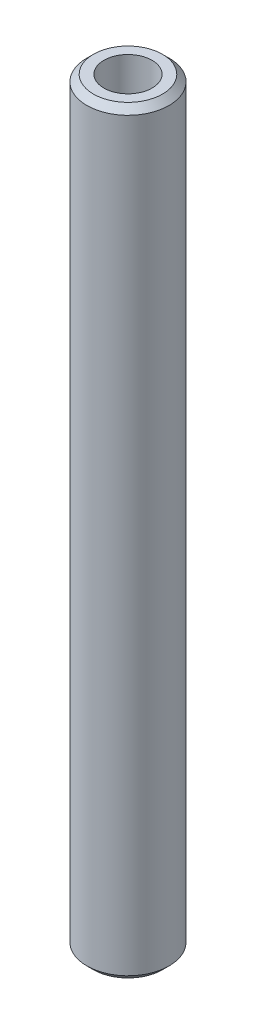
ISO-10303-21;
HEADER;
FILE_DESCRIPTION(('STEP AP214'),'2;1');
FILE_NAME('part.step','',(''),(''),'','','');
FILE_SCHEMA(('AUTOMOTIVE_DESIGN { 1 0 10303 214 1 1 1 1 }'));
ENDSEC;
DATA;
#1=APPLICATION_CONTEXT('core data for automotive mechanical design processes');
#2=APPLICATION_PROTOCOL_DEFINITION('international standard','automotive_design',2000,#1);
#3=PRODUCT_CONTEXT('',#1,'mechanical');
#4=PRODUCT('Part','Part','',(#3));
#5=PRODUCT_RELATED_PRODUCT_CATEGORY('part','',(#4));
#6=PRODUCT_DEFINITION_FORMATION('','',#4);
#7=PRODUCT_DEFINITION_CONTEXT('part definition',#1,'design');
#8=PRODUCT_DEFINITION('design','',#6,#7);
#9=PRODUCT_DEFINITION_SHAPE('','',#8);
#10=(LENGTH_UNIT() NAMED_UNIT(*) SI_UNIT(.MILLI.,.METRE.));
#11=(NAMED_UNIT(*) PLANE_ANGLE_UNIT() SI_UNIT($,.RADIAN.));
#12=(NAMED_UNIT(*) SI_UNIT($,.STERADIAN.) SOLID_ANGLE_UNIT());
#13=UNCERTAINTY_MEASURE_WITH_UNIT(LENGTH_MEASURE(1.E-05),#10,'distance_accuracy_value','');
#14=(GEOMETRIC_REPRESENTATION_CONTEXT(3) GLOBAL_UNCERTAINTY_ASSIGNED_CONTEXT((#13)) GLOBAL_UNIT_ASSIGNED_CONTEXT((#10,
#11,#12)) REPRESENTATION_CONTEXT('',''));
#15=CARTESIAN_POINT('',(0.,0.,0.));
#16=DIRECTION('',(0.,0.,1.));
#17=DIRECTION('',(1.,0.,0.));
#18=AXIS2_PLACEMENT_3D('',#15,#16,#17);
#19=CARTESIAN_POINT('',(0.,276.816888977512,0.));
#20=DIRECTION('',(0.,-1.,0.));
#21=DIRECTION('',(0.,0.,-1.));
#22=AXIS2_PLACEMENT_3D('',#19,#20,#21);
#23=CYLINDRICAL_SURFACE('',#22,15.);
#24=CARTESIAN_POINT('',(0.,274.419330907284,0.));
#25=DIRECTION('',(0.,1.,0.));
#26=DIRECTION('',(0.,0.,1.));
#27=AXIS2_PLACEMENT_3D('',#24,#25,#26);
#28=CIRCLE('',#27,15.);
#29=CARTESIAN_POINT('',(0.,274.419330907284,15.));
#30=VERTEX_POINT('',#29);
#31=EDGE_CURVE('E50',#30,#30,#28,.F.);
#32=ORIENTED_EDGE('',*,*,#31,.T.);
#33=EDGE_LOOP('',(#32));
#34=FACE_BOUND('',#33,.T.);
#35=CARTESIAN_POINT('',(0.,2.39755807022773,0.));
#36=DIRECTION('',(0.,1.,0.));
#37=DIRECTION('',(0.,0.,1.));
#38=AXIS2_PLACEMENT_3D('',#35,#36,#37);
#39=CIRCLE('',#38,15.);
#40=CARTESIAN_POINT('',(0.,2.39755807022773,15.));
#41=VERTEX_POINT('',#40);
#42=EDGE_CURVE('E51',#41,#41,#39,.T.);
#43=ORIENTED_EDGE('',*,*,#42,.T.);
#44=EDGE_LOOP('',(#43));
#45=FACE_BOUND('',#44,.T.);
#46=ADVANCED_FACE('F39',(#34,#45),#23,.T.);
#47=CARTESIAN_POINT('',(0.,276.816888977512,0.));
#48=DIRECTION('',(0.,1.,0.));
#49=DIRECTION('',(0.,0.,1.));
#50=AXIS2_PLACEMENT_3D('',#47,#48,#49);
#51=PLANE('',#50);
#52=CARTESIAN_POINT('',(0.,276.816888977512,0.));
#53=DIRECTION('',(0.,1.,0.));
#54=DIRECTION('',(0.,0.,1.));
#55=AXIS2_PLACEMENT_3D('',#52,#53,#54);
#56=CIRCLE('',#55,12.6024419297722);
#57=CARTESIAN_POINT('',(0.,276.816888977512,12.6024419297722));
#58=VERTEX_POINT('',#57);
#59=EDGE_CURVE('E54',#58,#58,#56,.T.);
#60=ORIENTED_EDGE('',*,*,#59,.T.);
#61=EDGE_LOOP('',(#60));
#62=FACE_BOUND('',#61,.T.);
#63=CARTESIAN_POINT('',(0.,276.816888977512,0.));
#64=DIRECTION('',(0.,1.,0.));
#65=DIRECTION('',(0.,0.,1.));
#66=AXIS2_PLACEMENT_3D('',#63,#64,#65);
#67=CIRCLE('',#66,8.80033520875781);
#68=CARTESIAN_POINT('',(0.,276.816888977512,8.80033520875781));
#69=VERTEX_POINT('',#68);
#70=EDGE_CURVE('E58',#69,#69,#67,.T.);
#71=ORIENTED_EDGE('',*,*,#70,.F.);
#72=EDGE_LOOP('',(#71));
#73=FACE_BOUND('',#72,.T.);
#74=ADVANCED_FACE('F69',(#62,#73),#51,.T.);
#75=CARTESIAN_POINT('',(0.,0.,0.));
#76=DIRECTION('',(0.,1.,0.));
#77=DIRECTION('',(0.,0.,1.));
#78=AXIS2_PLACEMENT_3D('',#75,#76,#77);
#79=PLANE('',#78);
#80=CARTESIAN_POINT('',(0.,0.,0.));
#81=DIRECTION('',(0.,1.,0.));
#82=DIRECTION('',(0.,0.,1.));
#83=AXIS2_PLACEMENT_3D('',#80,#81,#82);
#84=CIRCLE('',#83,12.6024419297723);
#85=CARTESIAN_POINT('',(0.,0.,12.6024419297723));
#86=VERTEX_POINT('',#85);
#87=EDGE_CURVE('E10',#86,#86,#84,.F.);
#88=ORIENTED_EDGE('',*,*,#87,.T.);
#89=EDGE_LOOP('',(#88));
#90=FACE_BOUND('',#89,.T.);
#91=CARTESIAN_POINT('',(0.,0.,0.));
#92=DIRECTION('',(0.,1.,0.));
#93=DIRECTION('',(0.,0.,1.));
#94=AXIS2_PLACEMENT_3D('',#91,#92,#93);
#95=CIRCLE('',#94,8.80033520875781);
#96=CARTESIAN_POINT('',(0.,0.,8.80033520875781));
#97=VERTEX_POINT('',#96);
#98=EDGE_CURVE('E63',#97,#97,#95,.T.);
#99=ORIENTED_EDGE('',*,*,#98,.T.);
#100=EDGE_LOOP('',(#99));
#101=FACE_BOUND('',#100,.T.);
#102=ADVANCED_FACE('F75',(#90,#101),#79,.F.);
#103=CARTESIAN_POINT('',(0.,276.816888977512,0.));
#104=DIRECTION('',(0.,-1.,0.));
#105=DIRECTION('',(0.,0.,-1.));
#106=AXIS2_PLACEMENT_3D('',#103,#104,#105);
#107=CYLINDRICAL_SURFACE('',#106,8.80033520875781);
#108=ORIENTED_EDGE('',*,*,#70,.T.);
#109=EDGE_LOOP('',(#108));
#110=FACE_BOUND('',#109,.T.);
#111=ORIENTED_EDGE('',*,*,#98,.F.);
#112=EDGE_LOOP('',(#111));
#113=FACE_BOUND('',#112,.T.);
#114=ADVANCED_FACE('F70',(#110,#113),#107,.F.);
#115=CARTESIAN_POINT('',(0.,276.816888977512,0.));
#116=DIRECTION('',(0.,-1.,0.));
#117=DIRECTION('',(0.,0.,-1.));
#118=AXIS2_PLACEMENT_3D('',#115,#116,#117);
#119=CONICAL_SURFACE('',#118,12.6024419297722,0.785398163397445);
#120=ORIENTED_EDGE('',*,*,#31,.F.);
#121=EDGE_LOOP('',(#120));
#122=FACE_BOUND('',#121,.T.);
#123=ORIENTED_EDGE('',*,*,#59,.F.);
#124=EDGE_LOOP('',(#123));
#125=FACE_BOUND('',#124,.T.);
#126=ADVANCED_FACE('F81',(#122,#125),#119,.T.);
#127=CARTESIAN_POINT('',(0.,2.39755807022773,0.));
#128=DIRECTION('',(0.,1.,0.));
#129=DIRECTION('',(0.,0.,1.));
#130=AXIS2_PLACEMENT_3D('',#127,#128,#129);
#131=CONICAL_SURFACE('',#130,15.,0.785398163397451);
#132=ORIENTED_EDGE('',*,*,#87,.F.);
#133=EDGE_LOOP('',(#132));
#134=FACE_BOUND('',#133,.T.);
#135=ORIENTED_EDGE('',*,*,#42,.F.);
#136=EDGE_LOOP('',(#135));
#137=FACE_BOUND('',#136,.T.);
#138=ADVANCED_FACE('F45',(#134,#137),#131,.T.);
#139=CLOSED_SHELL('',(#46,#74,#102,#114,#126,#138));
#140=MANIFOLD_SOLID_BREP('B2',#139);
#141=ADVANCED_BREP_SHAPE_REPRESENTATION('',(#18,#140),#14);
#142=SHAPE_DEFINITION_REPRESENTATION(#9,#141);
ENDSEC;
END-ISO-10303-21;
